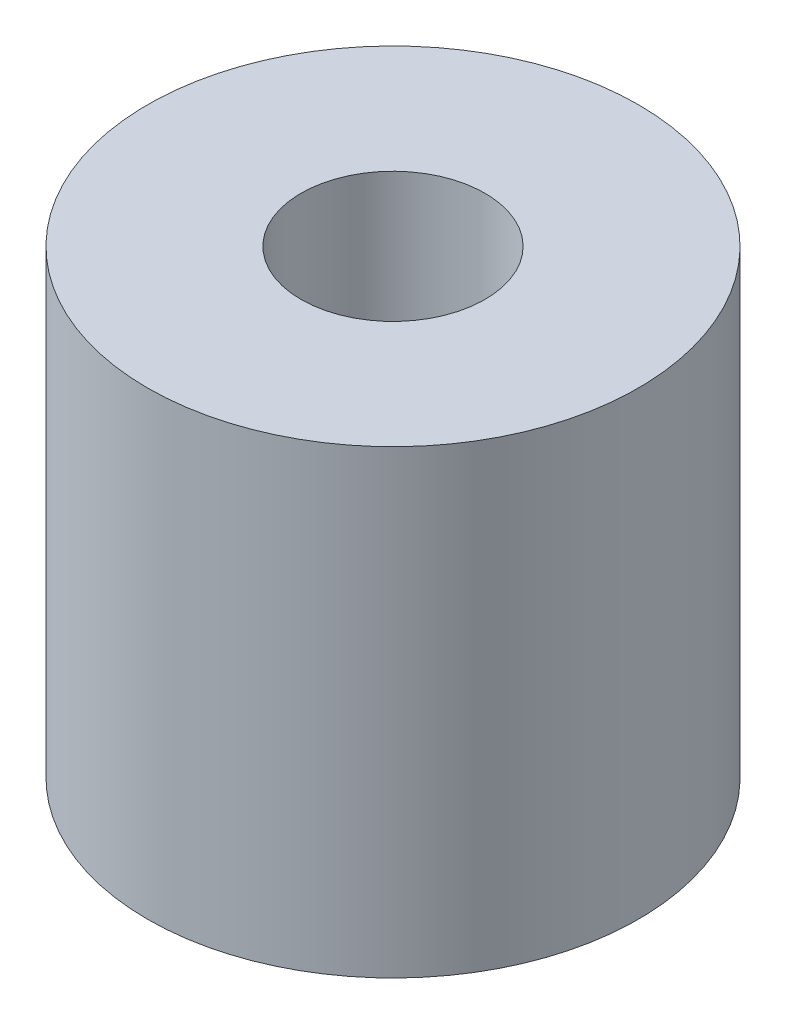
ISO-10303-21;
HEADER;
FILE_DESCRIPTION(('STEP AP214'),'2;1');
FILE_NAME('part.step','',(''),(''),'','','');
FILE_SCHEMA(('AUTOMOTIVE_DESIGN { 1 0 10303 214 1 1 1 1 }'));
ENDSEC;
DATA;
#1=APPLICATION_CONTEXT('core data for automotive mechanical design processes');
#2=APPLICATION_PROTOCOL_DEFINITION('international standard','automotive_design',2000,#1);
#3=PRODUCT_CONTEXT('',#1,'mechanical');
#4=PRODUCT('Part','Part','',(#3));
#5=PRODUCT_RELATED_PRODUCT_CATEGORY('part','',(#4));
#6=PRODUCT_DEFINITION_FORMATION('','',#4);
#7=PRODUCT_DEFINITION_CONTEXT('part definition',#1,'design');
#8=PRODUCT_DEFINITION('design','',#6,#7);
#9=PRODUCT_DEFINITION_SHAPE('','',#8);
#10=(LENGTH_UNIT() NAMED_UNIT(*) SI_UNIT(.MILLI.,.METRE.));
#11=(NAMED_UNIT(*) PLANE_ANGLE_UNIT() SI_UNIT($,.RADIAN.));
#12=(NAMED_UNIT(*) SI_UNIT($,.STERADIAN.) SOLID_ANGLE_UNIT());
#13=UNCERTAINTY_MEASURE_WITH_UNIT(LENGTH_MEASURE(1.E-05),#10,'distance_accuracy_value','');
#14=(GEOMETRIC_REPRESENTATION_CONTEXT(3) GLOBAL_UNCERTAINTY_ASSIGNED_CONTEXT((#13)) GLOBAL_UNIT_ASSIGNED_CONTEXT((#10,
#11,#12)) REPRESENTATION_CONTEXT('',''));
#15=CARTESIAN_POINT('',(0.,0.,0.));
#16=DIRECTION('',(0.,0.,1.));
#17=DIRECTION('',(1.,0.,0.));
#18=AXIS2_PLACEMENT_3D('',#15,#16,#17);
#19=CARTESIAN_POINT('',(0.,3.,0.));
#20=DIRECTION('',(0.,1.,0.));
#21=DIRECTION('',(0.,0.,1.));
#22=AXIS2_PLACEMENT_3D('',#19,#20,#21);
#23=PLANE('',#22);
#24=CARTESIAN_POINT('',(0.,3.,0.));
#25=DIRECTION('',(0.,1.,0.));
#26=DIRECTION('',(0.,0.,1.));
#27=AXIS2_PLACEMENT_3D('',#24,#25,#26);
#28=CIRCLE('',#27,1.6);
#29=CARTESIAN_POINT('',(0.,3.,1.6));
#30=VERTEX_POINT('',#29);
#31=EDGE_CURVE('E10',#30,#30,#28,.T.);
#32=ORIENTED_EDGE('',*,*,#31,.T.);
#33=EDGE_LOOP('',(#32));
#34=FACE_BOUND('',#33,.T.);
#35=CARTESIAN_POINT('',(0.,3.,0.));
#36=DIRECTION('',(0.,1.,0.));
#37=DIRECTION('',(0.,0.,1.));
#38=AXIS2_PLACEMENT_3D('',#35,#36,#37);
#39=CIRCLE('',#38,0.6);
#40=CARTESIAN_POINT('',(0.,3.,0.6));
#41=VERTEX_POINT('',#40);
#42=EDGE_CURVE('E48',#41,#41,#39,.T.);
#43=ORIENTED_EDGE('',*,*,#42,.F.);
#44=EDGE_LOOP('',(#43));
#45=FACE_BOUND('',#44,.T.);
#46=ADVANCED_FACE('F37',(#34,#45),#23,.T.);
#47=CARTESIAN_POINT('',(0.,0.,0.));
#48=DIRECTION('',(0.,1.,0.));
#49=DIRECTION('',(0.,0.,1.));
#50=AXIS2_PLACEMENT_3D('',#47,#48,#49);
#51=PLANE('',#50);
#52=CARTESIAN_POINT('',(0.,0.,0.));
#53=DIRECTION('',(0.,1.,0.));
#54=DIRECTION('',(0.,0.,1.));
#55=AXIS2_PLACEMENT_3D('',#52,#53,#54);
#56=CIRCLE('',#55,1.6);
#57=CARTESIAN_POINT('',(0.,0.,1.6));
#58=VERTEX_POINT('',#57);
#59=EDGE_CURVE('E41',#58,#58,#56,.T.);
#60=ORIENTED_EDGE('',*,*,#59,.F.);
#61=EDGE_LOOP('',(#60));
#62=FACE_BOUND('',#61,.T.);
#63=CARTESIAN_POINT('',(0.,0.,0.));
#64=DIRECTION('',(0.,1.,0.));
#65=DIRECTION('',(0.,0.,1.));
#66=AXIS2_PLACEMENT_3D('',#63,#64,#65);
#67=CIRCLE('',#66,0.6);
#68=CARTESIAN_POINT('',(0.,0.,0.6));
#69=VERTEX_POINT('',#68);
#70=EDGE_CURVE('E50',#69,#69,#67,.T.);
#71=ORIENTED_EDGE('',*,*,#70,.T.);
#72=EDGE_LOOP('',(#71));
#73=FACE_BOUND('',#72,.T.);
#74=ADVANCED_FACE('F60',(#62,#73),#51,.F.);
#75=CARTESIAN_POINT('',(0.,3.,0.));
#76=DIRECTION('',(0.,-1.,0.));
#77=DIRECTION('',(0.,0.,-1.));
#78=AXIS2_PLACEMENT_3D('',#75,#76,#77);
#79=CYLINDRICAL_SURFACE('',#78,1.6);
#80=ORIENTED_EDGE('',*,*,#31,.F.);
#81=EDGE_LOOP('',(#80));
#82=FACE_BOUND('',#81,.T.);
#83=ORIENTED_EDGE('',*,*,#59,.T.);
#84=EDGE_LOOP('',(#83));
#85=FACE_BOUND('',#84,.T.);
#86=ADVANCED_FACE('F39',(#82,#85),#79,.T.);
#87=CARTESIAN_POINT('',(0.,3.,0.));
#88=DIRECTION('',(0.,-1.,0.));
#89=DIRECTION('',(0.,0.,-1.));
#90=AXIS2_PLACEMENT_3D('',#87,#88,#89);
#91=CYLINDRICAL_SURFACE('',#90,0.6);
#92=ORIENTED_EDGE('',*,*,#42,.T.);
#93=EDGE_LOOP('',(#92));
#94=FACE_BOUND('',#93,.T.);
#95=ORIENTED_EDGE('',*,*,#70,.F.);
#96=EDGE_LOOP('',(#95));
#97=FACE_BOUND('',#96,.T.);
#98=ADVANCED_FACE('F56',(#94,#97),#91,.F.);
#99=CLOSED_SHELL('',(#46,#74,#86,#98));
#100=MANIFOLD_SOLID_BREP('B2',#99);
#101=ADVANCED_BREP_SHAPE_REPRESENTATION('',(#18,#100),#14);
#102=SHAPE_DEFINITION_REPRESENTATION(#9,#101);
ENDSEC;
END-ISO-10303-21;
